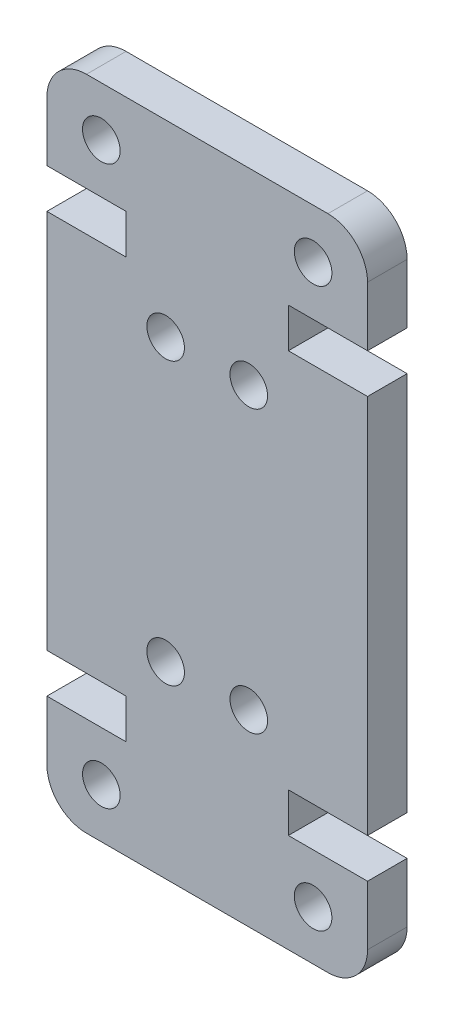
ISO-10303-21;
HEADER;
FILE_DESCRIPTION(('STEP AP214'),'2;1');
FILE_NAME('part.step','',(''),(''),'','','');
FILE_SCHEMA(('AUTOMOTIVE_DESIGN { 1 0 10303 214 1 1 1 1 }'));
ENDSEC;
DATA;
#1=APPLICATION_CONTEXT('core data for automotive mechanical design processes');
#2=APPLICATION_PROTOCOL_DEFINITION('international standard','automotive_design',2000,#1);
#3=PRODUCT_CONTEXT('',#1,'mechanical');
#4=PRODUCT('Part','Part','',(#3));
#5=PRODUCT_RELATED_PRODUCT_CATEGORY('part','',(#4));
#6=PRODUCT_DEFINITION_FORMATION('','',#4);
#7=PRODUCT_DEFINITION_CONTEXT('part definition',#1,'design');
#8=PRODUCT_DEFINITION('design','',#6,#7);
#9=PRODUCT_DEFINITION_SHAPE('','',#8);
#10=(LENGTH_UNIT() NAMED_UNIT(*) SI_UNIT(.MILLI.,.METRE.));
#11=(NAMED_UNIT(*) PLANE_ANGLE_UNIT() SI_UNIT($,.RADIAN.));
#12=(NAMED_UNIT(*) SI_UNIT($,.STERADIAN.) SOLID_ANGLE_UNIT());
#13=UNCERTAINTY_MEASURE_WITH_UNIT(LENGTH_MEASURE(1.E-05),#10,'distance_accuracy_value','');
#14=(GEOMETRIC_REPRESENTATION_CONTEXT(3) GLOBAL_UNCERTAINTY_ASSIGNED_CONTEXT((#13)) GLOBAL_UNIT_ASSIGNED_CONTEXT((#10,
#11,#12)) REPRESENTATION_CONTEXT('',''));
#15=CARTESIAN_POINT('',(0.,0.,0.));
#16=DIRECTION('',(0.,0.,1.));
#17=DIRECTION('',(1.,0.,0.));
#18=AXIS2_PLACEMENT_3D('',#15,#16,#17);
#19=CARTESIAN_POINT('',(2.00000000000001,2.,4.));
#20=DIRECTION('',(0.,0.,1.));
#21=DIRECTION('',(1.,0.,0.));
#22=AXIS2_PLACEMENT_3D('',#19,#20,#21);
#23=PLANE('',#22);
#24=CARTESIAN_POINT('',(10.2,23.7100000000004,4.));
#25=DIRECTION('',(0.,0.,1.));
#26=DIRECTION('',(1.,0.,0.));
#27=AXIS2_PLACEMENT_3D('',#24,#25,#26);
#28=CIRCLE('',#27,0.949999999999999);
#29=CARTESIAN_POINT('',(11.15,23.7100000000004,4.));
#30=VERTEX_POINT('',#29);
#31=EDGE_CURVE('E298',#30,#30,#28,.T.);
#32=ORIENTED_EDGE('',*,*,#31,.F.);
#33=EDGE_LOOP('',(#32));
#34=FACE_BOUND('',#33,.T.);
#35=CARTESIAN_POINT('',(6.,9.49999999999962,4.));
#36=DIRECTION('',(0.,0.,1.));
#37=DIRECTION('',(1.,0.,0.));
#38=AXIS2_PLACEMENT_3D('',#35,#36,#37);
#39=CIRCLE('',#38,0.95);
#40=CARTESIAN_POINT('',(6.95,9.49999999999962,4.));
#41=VERTEX_POINT('',#40);
#42=EDGE_CURVE('E304',#41,#41,#39,.T.);
#43=ORIENTED_EDGE('',*,*,#42,.F.);
#44=EDGE_LOOP('',(#43));
#45=FACE_BOUND('',#44,.T.);
#46=CARTESIAN_POINT('',(2.75000000000003,30.7099999999998,4.));
#47=DIRECTION('',(0.,0.,1.));
#48=DIRECTION('',(-1.,0.,0.));
#49=AXIS2_PLACEMENT_3D('',#46,#47,#48);
#50=CIRCLE('',#49,0.95);
#51=CARTESIAN_POINT('',(1.80000000000003,30.7099999999998,4.));
#52=VERTEX_POINT('',#51);
#53=EDGE_CURVE('E310',#52,#52,#50,.T.);
#54=ORIENTED_EDGE('',*,*,#53,.F.);
#55=EDGE_LOOP('',(#54));
#56=FACE_BOUND('',#55,.T.);
#57=CARTESIAN_POINT('',(13.45,2.50000000000017,4.));
#58=DIRECTION('',(0.,0.,1.));
#59=DIRECTION('',(-1.,0.,0.));
#60=AXIS2_PLACEMENT_3D('',#57,#58,#59);
#61=CIRCLE('',#60,0.949999999999999);
#62=CARTESIAN_POINT('',(12.5,2.50000000000017,4.));
#63=VERTEX_POINT('',#62);
#64=EDGE_CURVE('E316',#63,#63,#61,.T.);
#65=ORIENTED_EDGE('',*,*,#64,.F.);
#66=EDGE_LOOP('',(#65));
#67=FACE_BOUND('',#66,.T.);
#68=DIRECTION('',(1.,0.,0.));
#69=VECTOR('',#68,1.);
#70=CARTESIAN_POINT('',(0.,6.99999999999946,4.));
#71=LINE('',#70,#69);
#72=CARTESIAN_POINT('',(0.,6.99999999999946,4.));
#73=VERTEX_POINT('',#72);
#74=CARTESIAN_POINT('',(4.00000000000001,6.99999999999946,4.));
#75=VERTEX_POINT('',#74);
#76=EDGE_CURVE('E319',#73,#75,#71,.T.);
#77=ORIENTED_EDGE('',*,*,#76,.T.);
#78=DIRECTION('',(0.,-1.,0.));
#79=VECTOR('',#78,1.);
#80=CARTESIAN_POINT('',(4.00000000000001,6.99999999999946,4.));
#81=LINE('',#80,#79);
#82=CARTESIAN_POINT('',(4.,4.99999999999945,4.));
#83=VERTEX_POINT('',#82);
#84=EDGE_CURVE('E286',#75,#83,#81,.T.);
#85=ORIENTED_EDGE('',*,*,#84,.T.);
#86=DIRECTION('',(-1.,0.,0.));
#87=VECTOR('',#86,1.);
#88=CARTESIAN_POINT('',(4.,4.99999999999945,4.));
#89=LINE('',#88,#87);
#90=CARTESIAN_POINT('',(0.,4.99999999999945,4.));
#91=VERTEX_POINT('',#90);
#92=EDGE_CURVE('E282',#83,#91,#89,.T.);
#93=ORIENTED_EDGE('',*,*,#92,.T.);
#94=DIRECTION('',(0.,-1.,0.));
#95=VECTOR('',#94,1.);
#96=CARTESIAN_POINT('',(0.,2.,4.));
#97=LINE('',#96,#95);
#98=CARTESIAN_POINT('',(0.,2.,4.));
#99=VERTEX_POINT('',#98);
#100=EDGE_CURVE('E323',#91,#99,#97,.T.);
#101=ORIENTED_EDGE('',*,*,#100,.T.);
#102=CARTESIAN_POINT('',(2.00000000000001,2.,4.));
#103=DIRECTION('',(0.,0.,1.));
#104=DIRECTION('',(1.,0.,0.));
#105=AXIS2_PLACEMENT_3D('',#102,#103,#104);
#106=CIRCLE('',#105,2.00000000000001);
#107=CARTESIAN_POINT('',(2.00000000000001,0.,4.));
#108=VERTEX_POINT('',#107);
#109=EDGE_CURVE('E325',#99,#108,#106,.T.);
#110=ORIENTED_EDGE('',*,*,#109,.T.);
#111=DIRECTION('',(1.,0.,0.));
#112=VECTOR('',#111,1.);
#113=CARTESIAN_POINT('',(2.00000000000001,0.,4.));
#114=LINE('',#113,#112);
#115=CARTESIAN_POINT('',(14.2,0.,4.));
#116=VERTEX_POINT('',#115);
#117=EDGE_CURVE('E327',#108,#116,#114,.T.);
#118=ORIENTED_EDGE('',*,*,#117,.T.);
#119=CARTESIAN_POINT('',(14.2,2.,4.));
#120=DIRECTION('',(0.,0.,1.));
#121=DIRECTION('',(-1.,0.,0.));
#122=AXIS2_PLACEMENT_3D('',#119,#120,#121);
#123=CIRCLE('',#122,2.);
#124=CARTESIAN_POINT('',(16.2,2.,4.));
#125=VERTEX_POINT('',#124);
#126=EDGE_CURVE('E329',#116,#125,#123,.T.);
#127=ORIENTED_EDGE('',*,*,#126,.T.);
#128=DIRECTION('',(0.,1.,0.));
#129=VECTOR('',#128,1.);
#130=CARTESIAN_POINT('',(16.2,2.,4.));
#131=LINE('',#130,#129);
#132=CARTESIAN_POINT('',(16.2,4.99999999999945,4.));
#133=VERTEX_POINT('',#132);
#134=EDGE_CURVE('E331',#125,#133,#131,.T.);
#135=ORIENTED_EDGE('',*,*,#134,.T.);
#136=DIRECTION('',(-1.,0.,0.));
#137=VECTOR('',#136,1.);
#138=CARTESIAN_POINT('',(12.2,4.99999999999945,4.));
#139=LINE('',#138,#137);
#140=CARTESIAN_POINT('',(12.2,4.99999999999945,4.));
#141=VERTEX_POINT('',#140);
#142=EDGE_CURVE('E333',#133,#141,#139,.T.);
#143=ORIENTED_EDGE('',*,*,#142,.T.);
#144=DIRECTION('',(0.,1.,0.));
#145=VECTOR('',#144,1.);
#146=CARTESIAN_POINT('',(12.2,6.99999999999945,4.));
#147=LINE('',#146,#145);
#148=CARTESIAN_POINT('',(12.2,6.99999999999945,4.));
#149=VERTEX_POINT('',#148);
#150=EDGE_CURVE('E335',#141,#149,#147,.T.);
#151=ORIENTED_EDGE('',*,*,#150,.T.);
#152=DIRECTION('',(1.,0.,0.));
#153=VECTOR('',#152,1.);
#154=CARTESIAN_POINT('',(16.2,6.99999999999945,4.));
#155=LINE('',#154,#153);
#156=CARTESIAN_POINT('',(16.2,6.99999999999945,4.));
#157=VERTEX_POINT('',#156);
#158=EDGE_CURVE('E337',#149,#157,#155,.T.);
#159=ORIENTED_EDGE('',*,*,#158,.T.);
#160=DIRECTION('',(0.,1.,0.));
#161=VECTOR('',#160,1.);
#162=CARTESIAN_POINT('',(16.2,26.2100000000006,4.));
#163=LINE('',#162,#161);
#164=CARTESIAN_POINT('',(16.2,26.2100000000006,4.));
#165=VERTEX_POINT('',#164);
#166=EDGE_CURVE('E339',#157,#165,#163,.T.);
#167=ORIENTED_EDGE('',*,*,#166,.T.);
#168=DIRECTION('',(-1.,0.,0.));
#169=VECTOR('',#168,1.);
#170=CARTESIAN_POINT('',(16.2,26.2100000000006,4.));
#171=LINE('',#170,#169);
#172=CARTESIAN_POINT('',(12.2,26.2100000000006,4.));
#173=VERTEX_POINT('',#172);
#174=EDGE_CURVE('E341',#165,#173,#171,.T.);
#175=ORIENTED_EDGE('',*,*,#174,.T.);
#176=DIRECTION('',(0.,1.,0.));
#177=VECTOR('',#176,1.);
#178=CARTESIAN_POINT('',(12.2,26.2100000000006,4.));
#179=LINE('',#178,#177);
#180=CARTESIAN_POINT('',(12.2,28.2100000000006,4.));
#181=VERTEX_POINT('',#180);
#182=EDGE_CURVE('E343',#173,#181,#179,.T.);
#183=ORIENTED_EDGE('',*,*,#182,.T.);
#184=DIRECTION('',(1.,0.,0.));
#185=VECTOR('',#184,1.);
#186=CARTESIAN_POINT('',(12.2,28.2100000000006,4.));
#187=LINE('',#186,#185);
#188=CARTESIAN_POINT('',(16.2,28.2100000000006,4.));
#189=VERTEX_POINT('',#188);
#190=EDGE_CURVE('E345',#181,#189,#187,.T.);
#191=ORIENTED_EDGE('',*,*,#190,.T.);
#192=DIRECTION('',(0.,1.,0.));
#193=VECTOR('',#192,1.);
#194=CARTESIAN_POINT('',(16.2,31.21,4.));
#195=LINE('',#194,#193);
#196=CARTESIAN_POINT('',(16.2,31.21,4.));
#197=VERTEX_POINT('',#196);
#198=EDGE_CURVE('E347',#189,#197,#195,.T.);
#199=ORIENTED_EDGE('',*,*,#198,.T.);
#200=CARTESIAN_POINT('',(14.2,31.21,4.));
#201=DIRECTION('',(0.,0.,1.));
#202=DIRECTION('',(1.,0.,0.));
#203=AXIS2_PLACEMENT_3D('',#200,#201,#202);
#204=CIRCLE('',#203,2.);
#205=CARTESIAN_POINT('',(14.2,33.21,4.));
#206=VERTEX_POINT('',#205);
#207=EDGE_CURVE('E349',#197,#206,#204,.T.);
#208=ORIENTED_EDGE('',*,*,#207,.T.);
#209=DIRECTION('',(-1.,0.,0.));
#210=VECTOR('',#209,1.);
#211=CARTESIAN_POINT('',(1.99999999999999,33.21,4.));
#212=LINE('',#211,#210);
#213=CARTESIAN_POINT('',(1.99999999999999,33.21,4.));
#214=VERTEX_POINT('',#213);
#215=EDGE_CURVE('E351',#206,#214,#212,.T.);
#216=ORIENTED_EDGE('',*,*,#215,.T.);
#217=CARTESIAN_POINT('',(1.99999999999999,31.21,4.));
#218=DIRECTION('',(0.,0.,1.));
#219=DIRECTION('',(-1.,0.,0.));
#220=AXIS2_PLACEMENT_3D('',#217,#218,#219);
#221=CIRCLE('',#220,2.);
#222=CARTESIAN_POINT('',(0.,31.21,4.));
#223=VERTEX_POINT('',#222);
#224=EDGE_CURVE('E353',#214,#223,#221,.T.);
#225=ORIENTED_EDGE('',*,*,#224,.T.);
#226=DIRECTION('',(0.,-1.,0.));
#227=VECTOR('',#226,1.);
#228=CARTESIAN_POINT('',(0.,31.21,4.));
#229=LINE('',#228,#227);
#230=CARTESIAN_POINT('',(0.,28.2100000000006,4.));
#231=VERTEX_POINT('',#230);
#232=EDGE_CURVE('E221',#223,#231,#229,.T.);
#233=ORIENTED_EDGE('',*,*,#232,.T.);
#234=DIRECTION('',(1.,0.,0.));
#235=VECTOR('',#234,1.);
#236=CARTESIAN_POINT('',(3.99999999999999,28.2100000000006,4.));
#237=LINE('',#236,#235);
#238=CARTESIAN_POINT('',(3.99999999999999,28.2100000000006,4.));
#239=VERTEX_POINT('',#238);
#240=EDGE_CURVE('E356',#231,#239,#237,.T.);
#241=ORIENTED_EDGE('',*,*,#240,.T.);
#242=DIRECTION('',(0.,-1.,0.));
#243=VECTOR('',#242,1.);
#244=CARTESIAN_POINT('',(4.,26.2100000000006,4.));
#245=LINE('',#244,#243);
#246=CARTESIAN_POINT('',(4.,26.2100000000006,4.));
#247=VERTEX_POINT('',#246);
#248=EDGE_CURVE('E358',#239,#247,#245,.T.);
#249=ORIENTED_EDGE('',*,*,#248,.T.);
#250=DIRECTION('',(-1.,0.,0.));
#251=VECTOR('',#250,1.);
#252=CARTESIAN_POINT('',(0.,26.2100000000005,4.));
#253=LINE('',#252,#251);
#254=CARTESIAN_POINT('',(0.,26.2100000000005,4.));
#255=VERTEX_POINT('',#254);
#256=EDGE_CURVE('E360',#247,#255,#253,.T.);
#257=ORIENTED_EDGE('',*,*,#256,.T.);
#258=DIRECTION('',(0.,-1.,0.));
#259=VECTOR('',#258,1.);
#260=CARTESIAN_POINT('',(0.,26.2100000000005,4.));
#261=LINE('',#260,#259);
#262=EDGE_CURVE('E57',#255,#73,#261,.T.);
#263=ORIENTED_EDGE('',*,*,#262,.T.);
#264=EDGE_LOOP('',(#77,#85,#93,#101,#110,#118,#127,#135,#143,#151,#159,#167,#175,#183,#191,#199,
#208,#216,#225,#233,#241,#249,#257,#263));
#265=FACE_BOUND('',#264,.T.);
#266=CARTESIAN_POINT('',(10.2,9.49999999999962,4.));
#267=DIRECTION('',(0.,0.,1.));
#268=DIRECTION('',(-1.,0.,0.));
#269=AXIS2_PLACEMENT_3D('',#266,#267,#268);
#270=CIRCLE('',#269,0.949999999999999);
#271=CARTESIAN_POINT('',(9.25,9.49999999999962,4.));
#272=VERTEX_POINT('',#271);
#273=EDGE_CURVE('E313',#272,#272,#270,.T.);
#274=ORIENTED_EDGE('',*,*,#273,.F.);
#275=EDGE_LOOP('',(#274));
#276=FACE_BOUND('',#275,.T.);
#277=CARTESIAN_POINT('',(5.99999999999999,23.7100000000004,4.));
#278=DIRECTION('',(0.,0.,1.));
#279=DIRECTION('',(-1.,0.,0.));
#280=AXIS2_PLACEMENT_3D('',#277,#278,#279);
#281=CIRCLE('',#280,0.949999999999999);
#282=CARTESIAN_POINT('',(5.05,23.7100000000004,4.));
#283=VERTEX_POINT('',#282);
#284=EDGE_CURVE('E307',#283,#283,#281,.T.);
#285=ORIENTED_EDGE('',*,*,#284,.F.);
#286=EDGE_LOOP('',(#285));
#287=FACE_BOUND('',#286,.T.);
#288=CARTESIAN_POINT('',(2.75000000000004,2.50000000000017,4.));
#289=DIRECTION('',(0.,0.,1.));
#290=DIRECTION('',(1.,0.,0.));
#291=AXIS2_PLACEMENT_3D('',#288,#289,#290);
#292=CIRCLE('',#291,0.95);
#293=CARTESIAN_POINT('',(3.70000000000004,2.50000000000017,4.));
#294=VERTEX_POINT('',#293);
#295=EDGE_CURVE('E301',#294,#294,#292,.T.);
#296=ORIENTED_EDGE('',*,*,#295,.F.);
#297=EDGE_LOOP('',(#296));
#298=FACE_BOUND('',#297,.T.);
#299=CARTESIAN_POINT('',(13.45,30.7099999999998,4.));
#300=DIRECTION('',(0.,0.,1.));
#301=DIRECTION('',(1.,0.,0.));
#302=AXIS2_PLACEMENT_3D('',#299,#300,#301);
#303=CIRCLE('',#302,0.949999999999999);
#304=CARTESIAN_POINT('',(14.4,30.7099999999998,4.));
#305=VERTEX_POINT('',#304);
#306=EDGE_CURVE('E290',#305,#305,#303,.T.);
#307=ORIENTED_EDGE('',*,*,#306,.F.);
#308=EDGE_LOOP('',(#307));
#309=FACE_BOUND('',#308,.T.);
#310=ADVANCED_FACE('F33',(#34,#45,#56,#67,#265,#276,#287,#298,#309),#23,.T.);
#311=CARTESIAN_POINT('',(0.,6.99999999999946,4.));
#312=DIRECTION('',(0.,1.,0.));
#313=DIRECTION('',(0.,0.,1.));
#314=AXIS2_PLACEMENT_3D('',#311,#312,#313);
#315=PLANE('',#314);
#316=DIRECTION('',(0.,0.,-1.));
#317=VECTOR('',#316,1.);
#318=CARTESIAN_POINT('',(0.,6.99999999999946,4.));
#319=LINE('',#318,#317);
#320=CARTESIAN_POINT('',(0.,6.99999999999946,2.));
#321=VERTEX_POINT('',#320);
#322=EDGE_CURVE('E363',#73,#321,#319,.T.);
#323=ORIENTED_EDGE('',*,*,#322,.T.);
#324=DIRECTION('',(1.,0.,0.));
#325=VECTOR('',#324,1.);
#326=CARTESIAN_POINT('',(0.,6.99999999999946,2.));
#327=LINE('',#326,#325);
#328=CARTESIAN_POINT('',(4.00000000000001,6.99999999999946,2.));
#329=VERTEX_POINT('',#328);
#330=EDGE_CURVE('E49',#321,#329,#327,.T.);
#331=ORIENTED_EDGE('',*,*,#330,.T.);
#332=DIRECTION('',(0.,0.,-1.));
#333=VECTOR('',#332,1.);
#334=CARTESIAN_POINT('',(4.00000000000001,6.99999999999946,4.));
#335=LINE('',#334,#333);
#336=EDGE_CURVE('E11',#75,#329,#335,.T.);
#337=ORIENTED_EDGE('',*,*,#336,.F.);
#338=ORIENTED_EDGE('',*,*,#76,.F.);
#339=EDGE_LOOP('',(#323,#331,#337,#338));
#340=FACE_BOUND('',#339,.T.);
#341=ADVANCED_FACE('F35',(#340),#315,.F.);
#342=CARTESIAN_POINT('',(4.00000000000001,6.99999999999946,4.));
#343=DIRECTION('',(1.,0.,0.));
#344=DIRECTION('',(0.,1.,0.));
#345=AXIS2_PLACEMENT_3D('',#342,#343,#344);
#346=PLANE('',#345);
#347=ORIENTED_EDGE('',*,*,#336,.T.);
#348=DIRECTION('',(0.,-1.,0.));
#349=VECTOR('',#348,1.);
#350=CARTESIAN_POINT('',(4.00000000000001,6.99999999999946,2.));
#351=LINE('',#350,#349);
#352=CARTESIAN_POINT('',(4.,4.99999999999945,2.));
#353=VERTEX_POINT('',#352);
#354=EDGE_CURVE('E287',#329,#353,#351,.T.);
#355=ORIENTED_EDGE('',*,*,#354,.T.);
#356=DIRECTION('',(0.,0.,-1.));
#357=VECTOR('',#356,1.);
#358=CARTESIAN_POINT('',(4.,4.99999999999945,4.));
#359=LINE('',#358,#357);
#360=EDGE_CURVE('E42',#83,#353,#359,.T.);
#361=ORIENTED_EDGE('',*,*,#360,.F.);
#362=ORIENTED_EDGE('',*,*,#84,.F.);
#363=EDGE_LOOP('',(#347,#355,#361,#362));
#364=FACE_BOUND('',#363,.T.);
#365=ADVANCED_FACE('F285',(#364),#346,.F.);
#366=CARTESIAN_POINT('',(4.,4.99999999999945,4.));
#367=DIRECTION('',(0.,-1.,0.));
#368=DIRECTION('',(0.,0.,-1.));
#369=AXIS2_PLACEMENT_3D('',#366,#367,#368);
#370=PLANE('',#369);
#371=ORIENTED_EDGE('',*,*,#360,.T.);
#372=DIRECTION('',(-1.,0.,0.));
#373=VECTOR('',#372,1.);
#374=CARTESIAN_POINT('',(4.,4.99999999999945,2.));
#375=LINE('',#374,#373);
#376=CARTESIAN_POINT('',(0.,4.99999999999945,2.));
#377=VERTEX_POINT('',#376);
#378=EDGE_CURVE('E281',#353,#377,#375,.T.);
#379=ORIENTED_EDGE('',*,*,#378,.T.);
#380=DIRECTION('',(0.,0.,-1.));
#381=VECTOR('',#380,1.);
#382=CARTESIAN_POINT('',(0.,4.99999999999945,4.));
#383=LINE('',#382,#381);
#384=EDGE_CURVE('E271',#91,#377,#383,.T.);
#385=ORIENTED_EDGE('',*,*,#384,.F.);
#386=ORIENTED_EDGE('',*,*,#92,.F.);
#387=EDGE_LOOP('',(#371,#379,#385,#386));
#388=FACE_BOUND('',#387,.T.);
#389=ADVANCED_FACE('F279',(#388),#370,.F.);
#390=CARTESIAN_POINT('',(0.,2.,4.));
#391=DIRECTION('',(1.,0.,0.));
#392=DIRECTION('',(0.,0.,-1.));
#393=AXIS2_PLACEMENT_3D('',#390,#391,#392);
#394=PLANE('',#393);
#395=ORIENTED_EDGE('',*,*,#384,.T.);
#396=DIRECTION('',(0.,-1.,0.));
#397=VECTOR('',#396,1.);
#398=CARTESIAN_POINT('',(0.,33.21,2.));
#399=LINE('',#398,#397);
#400=CARTESIAN_POINT('',(0.,2.,2.));
#401=VERTEX_POINT('',#400);
#402=EDGE_CURVE('E208',#377,#401,#399,.T.);
#403=ORIENTED_EDGE('',*,*,#402,.T.);
#404=DIRECTION('',(0.,0.,-1.));
#405=VECTOR('',#404,1.);
#406=CARTESIAN_POINT('',(0.,2.,4.));
#407=LINE('',#406,#405);
#408=EDGE_CURVE('E268',#99,#401,#407,.T.);
#409=ORIENTED_EDGE('',*,*,#408,.F.);
#410=ORIENTED_EDGE('',*,*,#100,.F.);
#411=EDGE_LOOP('',(#395,#403,#409,#410));
#412=FACE_BOUND('',#411,.T.);
#413=ADVANCED_FACE('F426',(#412),#394,.F.);
#414=CARTESIAN_POINT('',(2.00000000000001,2.,4.));
#415=DIRECTION('',(0.,0.,-1.));
#416=DIRECTION('',(-1.,0.,0.));
#417=AXIS2_PLACEMENT_3D('',#414,#415,#416);
#418=CYLINDRICAL_SURFACE('',#417,2.00000000000001);
#419=ORIENTED_EDGE('',*,*,#408,.T.);
#420=CARTESIAN_POINT('',(2.00000000000001,2.,2.));
#421=DIRECTION('',(0.,0.,1.));
#422=DIRECTION('',(1.,0.,0.));
#423=AXIS2_PLACEMENT_3D('',#420,#421,#422);
#424=CIRCLE('',#423,2.00000000000001);
#425=CARTESIAN_POINT('',(2.00000000000001,0.,2.));
#426=VERTEX_POINT('',#425);
#427=EDGE_CURVE('E292',#401,#426,#424,.T.);
#428=ORIENTED_EDGE('',*,*,#427,.T.);
#429=DIRECTION('',(0.,0.,-1.));
#430=VECTOR('',#429,1.);
#431=CARTESIAN_POINT('',(2.00000000000001,0.,4.));
#432=LINE('',#431,#430);
#433=EDGE_CURVE('E265',#108,#426,#432,.T.);
#434=ORIENTED_EDGE('',*,*,#433,.F.);
#435=ORIENTED_EDGE('',*,*,#109,.F.);
#436=EDGE_LOOP('',(#419,#428,#434,#435));
#437=FACE_BOUND('',#436,.T.);
#438=ADVANCED_FACE('F412',(#437),#418,.T.);
#439=CARTESIAN_POINT('',(2.00000000000001,0.,4.));
#440=DIRECTION('',(0.,1.,0.));
#441=DIRECTION('',(-1.,0.,0.));
#442=AXIS2_PLACEMENT_3D('',#439,#440,#441);
#443=PLANE('',#442);
#444=ORIENTED_EDGE('',*,*,#433,.T.);
#445=DIRECTION('',(1.,0.,0.));
#446=VECTOR('',#445,1.);
#447=CARTESIAN_POINT('',(0.,0.,2.));
#448=LINE('',#447,#446);
#449=CARTESIAN_POINT('',(14.2,0.,2.));
#450=VERTEX_POINT('',#449);
#451=EDGE_CURVE('E205',#426,#450,#448,.T.);
#452=ORIENTED_EDGE('',*,*,#451,.T.);
#453=DIRECTION('',(0.,0.,-1.));
#454=VECTOR('',#453,1.);
#455=CARTESIAN_POINT('',(14.2,0.,4.));
#456=LINE('',#455,#454);
#457=EDGE_CURVE('E262',#116,#450,#456,.T.);
#458=ORIENTED_EDGE('',*,*,#457,.F.);
#459=ORIENTED_EDGE('',*,*,#117,.F.);
#460=EDGE_LOOP('',(#444,#452,#458,#459));
#461=FACE_BOUND('',#460,.T.);
#462=ADVANCED_FACE('F419',(#461),#443,.F.);
#463=CARTESIAN_POINT('',(14.2,2.,4.));
#464=DIRECTION('',(0.,0.,-1.));
#465=DIRECTION('',(-1.,0.,0.));
#466=AXIS2_PLACEMENT_3D('',#463,#464,#465);
#467=CYLINDRICAL_SURFACE('',#466,2.);
#468=ORIENTED_EDGE('',*,*,#457,.T.);
#469=CARTESIAN_POINT('',(14.2,2.,2.));
#470=DIRECTION('',(0.,0.,1.));
#471=DIRECTION('',(1.,0.,0.));
#472=AXIS2_PLACEMENT_3D('',#469,#470,#471);
#473=CIRCLE('',#472,2.);
#474=CARTESIAN_POINT('',(16.2,2.,2.));
#475=VERTEX_POINT('',#474);
#476=EDGE_CURVE('E407',#450,#475,#473,.T.);
#477=ORIENTED_EDGE('',*,*,#476,.T.);
#478=DIRECTION('',(0.,0.,-1.));
#479=VECTOR('',#478,1.);
#480=CARTESIAN_POINT('',(16.2,2.,4.));
#481=LINE('',#480,#479);
#482=EDGE_CURVE('E259',#125,#475,#481,.T.);
#483=ORIENTED_EDGE('',*,*,#482,.F.);
#484=ORIENTED_EDGE('',*,*,#126,.F.);
#485=EDGE_LOOP('',(#468,#477,#483,#484));
#486=FACE_BOUND('',#485,.T.);
#487=ADVANCED_FACE('F535',(#486),#467,.T.);
#488=CARTESIAN_POINT('',(16.2,2.,4.));
#489=DIRECTION('',(-1.,0.,0.));
#490=DIRECTION('',(0.,0.,1.));
#491=AXIS2_PLACEMENT_3D('',#488,#489,#490);
#492=PLANE('',#491);
#493=ORIENTED_EDGE('',*,*,#482,.T.);
#494=DIRECTION('',(0.,1.,0.));
#495=VECTOR('',#494,1.);
#496=CARTESIAN_POINT('',(16.2,0.,2.));
#497=LINE('',#496,#495);
#498=CARTESIAN_POINT('',(16.2,4.99999999999945,2.));
#499=VERTEX_POINT('',#498);
#500=EDGE_CURVE('E433',#475,#499,#497,.T.);
#501=ORIENTED_EDGE('',*,*,#500,.T.);
#502=DIRECTION('',(0.,0.,-1.));
#503=VECTOR('',#502,1.);
#504=CARTESIAN_POINT('',(16.2,4.99999999999945,4.));
#505=LINE('',#504,#503);
#506=EDGE_CURVE('E256',#133,#499,#505,.T.);
#507=ORIENTED_EDGE('',*,*,#506,.F.);
#508=ORIENTED_EDGE('',*,*,#134,.F.);
#509=EDGE_LOOP('',(#493,#501,#507,#508));
#510=FACE_BOUND('',#509,.T.);
#511=ADVANCED_FACE('F531',(#510),#492,.F.);
#512=CARTESIAN_POINT('',(12.2,4.99999999999945,4.));
#513=DIRECTION('',(0.,-1.,0.));
#514=DIRECTION('',(0.,0.,-1.));
#515=AXIS2_PLACEMENT_3D('',#512,#513,#514);
#516=PLANE('',#515);
#517=ORIENTED_EDGE('',*,*,#506,.T.);
#518=DIRECTION('',(-1.,0.,0.));
#519=VECTOR('',#518,1.);
#520=CARTESIAN_POINT('',(12.2,4.99999999999945,2.));
#521=LINE('',#520,#519);
#522=CARTESIAN_POINT('',(12.2,4.99999999999945,2.));
#523=VERTEX_POINT('',#522);
#524=EDGE_CURVE('E404',#499,#523,#521,.T.);
#525=ORIENTED_EDGE('',*,*,#524,.T.);
#526=DIRECTION('',(0.,0.,-1.));
#527=VECTOR('',#526,1.);
#528=CARTESIAN_POINT('',(12.2,4.99999999999945,4.));
#529=LINE('',#528,#527);
#530=EDGE_CURVE('E253',#141,#523,#529,.T.);
#531=ORIENTED_EDGE('',*,*,#530,.F.);
#532=ORIENTED_EDGE('',*,*,#142,.F.);
#533=EDGE_LOOP('',(#517,#525,#531,#532));
#534=FACE_BOUND('',#533,.T.);
#535=ADVANCED_FACE('F527',(#534),#516,.F.);
#536=CARTESIAN_POINT('',(12.2,6.99999999999945,4.));
#537=DIRECTION('',(-1.,0.,0.));
#538=DIRECTION('',(0.,0.,1.));
#539=AXIS2_PLACEMENT_3D('',#536,#537,#538);
#540=PLANE('',#539);
#541=ORIENTED_EDGE('',*,*,#530,.T.);
#542=DIRECTION('',(0.,1.,0.));
#543=VECTOR('',#542,1.);
#544=CARTESIAN_POINT('',(12.2,6.99999999999945,2.));
#545=LINE('',#544,#543);
#546=CARTESIAN_POINT('',(12.2,6.99999999999945,2.));
#547=VERTEX_POINT('',#546);
#548=EDGE_CURVE('E401',#523,#547,#545,.T.);
#549=ORIENTED_EDGE('',*,*,#548,.T.);
#550=DIRECTION('',(0.,0.,-1.));
#551=VECTOR('',#550,1.);
#552=CARTESIAN_POINT('',(12.2,6.99999999999945,4.));
#553=LINE('',#552,#551);
#554=EDGE_CURVE('E250',#149,#547,#553,.T.);
#555=ORIENTED_EDGE('',*,*,#554,.F.);
#556=ORIENTED_EDGE('',*,*,#150,.F.);
#557=EDGE_LOOP('',(#541,#549,#555,#556));
#558=FACE_BOUND('',#557,.T.);
#559=ADVANCED_FACE('F523',(#558),#540,.F.);
#560=CARTESIAN_POINT('',(16.2,6.99999999999945,4.));
#561=DIRECTION('',(0.,1.,0.));
#562=DIRECTION('',(-1.,0.,0.));
#563=AXIS2_PLACEMENT_3D('',#560,#561,#562);
#564=PLANE('',#563);
#565=ORIENTED_EDGE('',*,*,#554,.T.);
#566=DIRECTION('',(1.,0.,0.));
#567=VECTOR('',#566,1.);
#568=CARTESIAN_POINT('',(16.2,6.99999999999945,2.));
#569=LINE('',#568,#567);
#570=CARTESIAN_POINT('',(16.2,6.99999999999945,2.));
#571=VERTEX_POINT('',#570);
#572=EDGE_CURVE('E398',#547,#571,#569,.T.);
#573=ORIENTED_EDGE('',*,*,#572,.T.);
#574=DIRECTION('',(0.,0.,-1.));
#575=VECTOR('',#574,1.);
#576=CARTESIAN_POINT('',(16.2,6.99999999999945,4.));
#577=LINE('',#576,#575);
#578=EDGE_CURVE('E247',#157,#571,#577,.T.);
#579=ORIENTED_EDGE('',*,*,#578,.F.);
#580=ORIENTED_EDGE('',*,*,#158,.F.);
#581=EDGE_LOOP('',(#565,#573,#579,#580));
#582=FACE_BOUND('',#581,.T.);
#583=ADVANCED_FACE('F519',(#582),#564,.F.);
#584=CARTESIAN_POINT('',(16.2,26.2100000000006,4.));
#585=DIRECTION('',(-1.,0.,0.));
#586=DIRECTION('',(0.,0.,1.));
#587=AXIS2_PLACEMENT_3D('',#584,#585,#586);
#588=PLANE('',#587);
#589=ORIENTED_EDGE('',*,*,#578,.T.);
#590=CARTESIAN_POINT('',(16.2,26.2100000000006,2.));
#591=VERTEX_POINT('',#590);
#592=EDGE_CURVE('E432',#571,#591,#497,.T.);
#593=ORIENTED_EDGE('',*,*,#592,.T.);
#594=DIRECTION('',(0.,0.,-1.));
#595=VECTOR('',#594,1.);
#596=CARTESIAN_POINT('',(16.2,26.2100000000006,4.));
#597=LINE('',#596,#595);
#598=EDGE_CURVE('E244',#165,#591,#597,.T.);
#599=ORIENTED_EDGE('',*,*,#598,.F.);
#600=ORIENTED_EDGE('',*,*,#166,.F.);
#601=EDGE_LOOP('',(#589,#593,#599,#600));
#602=FACE_BOUND('',#601,.T.);
#603=ADVANCED_FACE('F515',(#602),#588,.F.);
#604=CARTESIAN_POINT('',(16.2,26.2100000000006,4.));
#605=DIRECTION('',(0.,-1.,0.));
#606=DIRECTION('',(0.,0.,-1.));
#607=AXIS2_PLACEMENT_3D('',#604,#605,#606);
#608=PLANE('',#607);
#609=ORIENTED_EDGE('',*,*,#598,.T.);
#610=DIRECTION('',(-1.,0.,0.));
#611=VECTOR('',#610,1.);
#612=CARTESIAN_POINT('',(16.2,26.2100000000006,2.));
#613=LINE('',#612,#611);
#614=CARTESIAN_POINT('',(12.2,26.2100000000006,2.));
#615=VERTEX_POINT('',#614);
#616=EDGE_CURVE('E395',#591,#615,#613,.T.);
#617=ORIENTED_EDGE('',*,*,#616,.T.);
#618=DIRECTION('',(0.,0.,-1.));
#619=VECTOR('',#618,1.);
#620=CARTESIAN_POINT('',(12.2,26.2100000000006,4.));
#621=LINE('',#620,#619);
#622=EDGE_CURVE('E241',#173,#615,#621,.T.);
#623=ORIENTED_EDGE('',*,*,#622,.F.);
#624=ORIENTED_EDGE('',*,*,#174,.F.);
#625=EDGE_LOOP('',(#609,#617,#623,#624));
#626=FACE_BOUND('',#625,.T.);
#627=ADVANCED_FACE('F511',(#626),#608,.F.);
#628=CARTESIAN_POINT('',(12.2,26.2100000000006,4.));
#629=DIRECTION('',(-1.,0.,0.));
#630=DIRECTION('',(0.,-1.,0.));
#631=AXIS2_PLACEMENT_3D('',#628,#629,#630);
#632=PLANE('',#631);
#633=ORIENTED_EDGE('',*,*,#622,.T.);
#634=DIRECTION('',(0.,1.,0.));
#635=VECTOR('',#634,1.);
#636=CARTESIAN_POINT('',(12.2,26.2100000000006,2.));
#637=LINE('',#636,#635);
#638=CARTESIAN_POINT('',(12.2,28.2100000000006,2.));
#639=VERTEX_POINT('',#638);
#640=EDGE_CURVE('E392',#615,#639,#637,.T.);
#641=ORIENTED_EDGE('',*,*,#640,.T.);
#642=DIRECTION('',(0.,0.,-1.));
#643=VECTOR('',#642,1.);
#644=CARTESIAN_POINT('',(12.2,28.2100000000006,4.));
#645=LINE('',#644,#643);
#646=EDGE_CURVE('E238',#181,#639,#645,.T.);
#647=ORIENTED_EDGE('',*,*,#646,.F.);
#648=ORIENTED_EDGE('',*,*,#182,.F.);
#649=EDGE_LOOP('',(#633,#641,#647,#648));
#650=FACE_BOUND('',#649,.T.);
#651=ADVANCED_FACE('F507',(#650),#632,.F.);
#652=CARTESIAN_POINT('',(12.2,28.2100000000006,4.));
#653=DIRECTION('',(0.,1.,0.));
#654=DIRECTION('',(0.,0.,1.));
#655=AXIS2_PLACEMENT_3D('',#652,#653,#654);
#656=PLANE('',#655);
#657=ORIENTED_EDGE('',*,*,#646,.T.);
#658=DIRECTION('',(1.,0.,0.));
#659=VECTOR('',#658,1.);
#660=CARTESIAN_POINT('',(12.2,28.2100000000006,2.));
#661=LINE('',#660,#659);
#662=CARTESIAN_POINT('',(16.2,28.2100000000006,2.));
#663=VERTEX_POINT('',#662);
#664=EDGE_CURVE('E389',#639,#663,#661,.T.);
#665=ORIENTED_EDGE('',*,*,#664,.T.);
#666=DIRECTION('',(0.,0.,-1.));
#667=VECTOR('',#666,1.);
#668=CARTESIAN_POINT('',(16.2,28.2100000000006,4.));
#669=LINE('',#668,#667);
#670=EDGE_CURVE('E235',#189,#663,#669,.T.);
#671=ORIENTED_EDGE('',*,*,#670,.F.);
#672=ORIENTED_EDGE('',*,*,#190,.F.);
#673=EDGE_LOOP('',(#657,#665,#671,#672));
#674=FACE_BOUND('',#673,.T.);
#675=ADVANCED_FACE('F503',(#674),#656,.F.);
#676=CARTESIAN_POINT('',(16.2,31.21,4.));
#677=DIRECTION('',(-1.,0.,0.));
#678=DIRECTION('',(0.,0.,1.));
#679=AXIS2_PLACEMENT_3D('',#676,#677,#678);
#680=PLANE('',#679);
#681=ORIENTED_EDGE('',*,*,#670,.T.);
#682=CARTESIAN_POINT('',(16.2,31.21,2.));
#683=VERTEX_POINT('',#682);
#684=EDGE_CURVE('E429',#663,#683,#497,.T.);
#685=ORIENTED_EDGE('',*,*,#684,.T.);
#686=DIRECTION('',(0.,0.,-1.));
#687=VECTOR('',#686,1.);
#688=CARTESIAN_POINT('',(16.2,31.21,4.));
#689=LINE('',#688,#687);
#690=EDGE_CURVE('E232',#197,#683,#689,.T.);
#691=ORIENTED_EDGE('',*,*,#690,.F.);
#692=ORIENTED_EDGE('',*,*,#198,.F.);
#693=EDGE_LOOP('',(#681,#685,#691,#692));
#694=FACE_BOUND('',#693,.T.);
#695=ADVANCED_FACE('F499',(#694),#680,.F.);
#696=CARTESIAN_POINT('',(14.2,31.21,4.));
#697=DIRECTION('',(0.,0.,-1.));
#698=DIRECTION('',(-1.,0.,0.));
#699=AXIS2_PLACEMENT_3D('',#696,#697,#698);
#700=CYLINDRICAL_SURFACE('',#699,2.);
#701=ORIENTED_EDGE('',*,*,#690,.T.);
#702=CARTESIAN_POINT('',(14.2,31.21,2.));
#703=DIRECTION('',(0.,0.,1.));
#704=DIRECTION('',(1.,0.,0.));
#705=AXIS2_PLACEMENT_3D('',#702,#703,#704);
#706=CIRCLE('',#705,2.);
#707=CARTESIAN_POINT('',(14.2,33.21,2.));
#708=VERTEX_POINT('',#707);
#709=EDGE_CURVE('E218',#683,#708,#706,.T.);
#710=ORIENTED_EDGE('',*,*,#709,.T.);
#711=DIRECTION('',(0.,0.,-1.));
#712=VECTOR('',#711,1.);
#713=CARTESIAN_POINT('',(14.2,33.21,4.));
#714=LINE('',#713,#712);
#715=EDGE_CURVE('E224',#206,#708,#714,.T.);
#716=ORIENTED_EDGE('',*,*,#715,.F.);
#717=ORIENTED_EDGE('',*,*,#207,.F.);
#718=EDGE_LOOP('',(#701,#710,#716,#717));
#719=FACE_BOUND('',#718,.T.);
#720=ADVANCED_FACE('F495',(#719),#700,.T.);
#721=CARTESIAN_POINT('',(1.99999999999999,33.21,4.));
#722=DIRECTION('',(0.,-1.,0.));
#723=DIRECTION('',(0.,0.,-1.));
#724=AXIS2_PLACEMENT_3D('',#721,#722,#723);
#725=PLANE('',#724);
#726=ORIENTED_EDGE('',*,*,#715,.T.);
#727=DIRECTION('',(-1.,0.,0.));
#728=VECTOR('',#727,1.);
#729=CARTESIAN_POINT('',(16.2,33.21,2.));
#730=LINE('',#729,#728);
#731=CARTESIAN_POINT('',(1.99999999999999,33.21,2.));
#732=VERTEX_POINT('',#731);
#733=EDGE_CURVE('E434',#708,#732,#730,.T.);
#734=ORIENTED_EDGE('',*,*,#733,.T.);
#735=DIRECTION('',(0.,0.,-1.));
#736=VECTOR('',#735,1.);
#737=CARTESIAN_POINT('',(1.99999999999999,33.21,4.));
#738=LINE('',#737,#736);
#739=EDGE_CURVE('E217',#214,#732,#738,.T.);
#740=ORIENTED_EDGE('',*,*,#739,.F.);
#741=ORIENTED_EDGE('',*,*,#215,.F.);
#742=EDGE_LOOP('',(#726,#734,#740,#741));
#743=FACE_BOUND('',#742,.T.);
#744=ADVANCED_FACE('F492',(#743),#725,.F.);
#745=CARTESIAN_POINT('',(1.99999999999999,31.21,4.));
#746=DIRECTION('',(0.,0.,-1.));
#747=DIRECTION('',(-1.,0.,0.));
#748=AXIS2_PLACEMENT_3D('',#745,#746,#747);
#749=CYLINDRICAL_SURFACE('',#748,2.);
#750=ORIENTED_EDGE('',*,*,#739,.T.);
#751=CARTESIAN_POINT('',(1.99999999999999,31.21,2.));
#752=DIRECTION('',(0.,0.,1.));
#753=DIRECTION('',(1.,0.,0.));
#754=AXIS2_PLACEMENT_3D('',#751,#752,#753);
#755=CIRCLE('',#754,2.);
#756=CARTESIAN_POINT('',(0.,31.21,2.));
#757=VERTEX_POINT('',#756);
#758=EDGE_CURVE('E197',#732,#757,#755,.T.);
#759=ORIENTED_EDGE('',*,*,#758,.T.);
#760=DIRECTION('',(0.,0.,-1.));
#761=VECTOR('',#760,1.);
#762=CARTESIAN_POINT('',(0.,31.21,4.));
#763=LINE('',#762,#761);
#764=EDGE_CURVE('E214',#223,#757,#763,.T.);
#765=ORIENTED_EDGE('',*,*,#764,.F.);
#766=ORIENTED_EDGE('',*,*,#224,.F.);
#767=EDGE_LOOP('',(#750,#759,#765,#766));
#768=FACE_BOUND('',#767,.T.);
#769=ADVANCED_FACE('F212',(#768),#749,.T.);
#770=CARTESIAN_POINT('',(0.,31.21,4.));
#771=DIRECTION('',(1.,0.,0.));
#772=DIRECTION('',(0.,1.,0.));
#773=AXIS2_PLACEMENT_3D('',#770,#771,#772);
#774=PLANE('',#773);
#775=ORIENTED_EDGE('',*,*,#764,.T.);
#776=CARTESIAN_POINT('',(0.,28.2100000000006,2.));
#777=VERTEX_POINT('',#776);
#778=EDGE_CURVE('E194',#757,#777,#399,.T.);
#779=ORIENTED_EDGE('',*,*,#778,.T.);
#780=DIRECTION('',(0.,0.,-1.));
#781=VECTOR('',#780,1.);
#782=CARTESIAN_POINT('',(0.,28.2100000000006,4.));
#783=LINE('',#782,#781);
#784=EDGE_CURVE('E222',#231,#777,#783,.T.);
#785=ORIENTED_EDGE('',*,*,#784,.F.);
#786=ORIENTED_EDGE('',*,*,#232,.F.);
#787=EDGE_LOOP('',(#775,#779,#785,#786));
#788=FACE_BOUND('',#787,.T.);
#789=ADVANCED_FACE('F220',(#788),#774,.F.);
#790=CARTESIAN_POINT('',(3.99999999999999,28.2100000000006,4.));
#791=DIRECTION('',(0.,1.,0.));
#792=DIRECTION('',(-1.,0.,0.));
#793=AXIS2_PLACEMENT_3D('',#790,#791,#792);
#794=PLANE('',#793);
#795=ORIENTED_EDGE('',*,*,#784,.T.);
#796=DIRECTION('',(1.,0.,0.));
#797=VECTOR('',#796,1.);
#798=CARTESIAN_POINT('',(3.99999999999999,28.2100000000006,2.));
#799=LINE('',#798,#797);
#800=CARTESIAN_POINT('',(3.99999999999999,28.2100000000006,2.));
#801=VERTEX_POINT('',#800);
#802=EDGE_CURVE('E200',#777,#801,#799,.T.);
#803=ORIENTED_EDGE('',*,*,#802,.T.);
#804=DIRECTION('',(0.,0.,-1.));
#805=VECTOR('',#804,1.);
#806=CARTESIAN_POINT('',(3.99999999999999,28.2100000000006,4.));
#807=LINE('',#806,#805);
#808=EDGE_CURVE('E226',#239,#801,#807,.T.);
#809=ORIENTED_EDGE('',*,*,#808,.F.);
#810=ORIENTED_EDGE('',*,*,#240,.F.);
#811=EDGE_LOOP('',(#795,#803,#809,#810));
#812=FACE_BOUND('',#811,.T.);
#813=ADVANCED_FACE('F381',(#812),#794,.F.);
#814=CARTESIAN_POINT('',(4.,26.2100000000006,4.));
#815=DIRECTION('',(1.,0.,0.));
#816=DIRECTION('',(0.,1.,0.));
#817=AXIS2_PLACEMENT_3D('',#814,#815,#816);
#818=PLANE('',#817);
#819=ORIENTED_EDGE('',*,*,#808,.T.);
#820=DIRECTION('',(0.,-1.,0.));
#821=VECTOR('',#820,1.);
#822=CARTESIAN_POINT('',(4.,26.2100000000006,2.));
#823=LINE('',#822,#821);
#824=CARTESIAN_POINT('',(4.,26.2100000000006,2.));
#825=VERTEX_POINT('',#824);
#826=EDGE_CURVE('E378',#801,#825,#823,.T.);
#827=ORIENTED_EDGE('',*,*,#826,.T.);
#828=DIRECTION('',(0.,0.,-1.));
#829=VECTOR('',#828,1.);
#830=CARTESIAN_POINT('',(4.,26.2100000000006,4.));
#831=LINE('',#830,#829);
#832=EDGE_CURVE('E369',#247,#825,#831,.T.);
#833=ORIENTED_EDGE('',*,*,#832,.F.);
#834=ORIENTED_EDGE('',*,*,#248,.F.);
#835=EDGE_LOOP('',(#819,#827,#833,#834));
#836=FACE_BOUND('',#835,.T.);
#837=ADVANCED_FACE('F376',(#836),#818,.F.);
#838=CARTESIAN_POINT('',(0.,26.2100000000005,4.));
#839=DIRECTION('',(0.,-1.,0.));
#840=DIRECTION('',(1.,0.,0.));
#841=AXIS2_PLACEMENT_3D('',#838,#839,#840);
#842=PLANE('',#841);
#843=ORIENTED_EDGE('',*,*,#832,.T.);
#844=DIRECTION('',(-1.,0.,0.));
#845=VECTOR('',#844,1.);
#846=CARTESIAN_POINT('',(0.,26.2100000000005,2.));
#847=LINE('',#846,#845);
#848=CARTESIAN_POINT('',(0.,26.2100000000005,2.));
#849=VERTEX_POINT('',#848);
#850=EDGE_CURVE('E383',#825,#849,#847,.T.);
#851=ORIENTED_EDGE('',*,*,#850,.T.);
#852=DIRECTION('',(0.,0.,-1.));
#853=VECTOR('',#852,1.);
#854=CARTESIAN_POINT('',(0.,26.2100000000005,4.));
#855=LINE('',#854,#853);
#856=EDGE_CURVE('E366',#255,#849,#855,.T.);
#857=ORIENTED_EDGE('',*,*,#856,.F.);
#858=ORIENTED_EDGE('',*,*,#256,.F.);
#859=EDGE_LOOP('',(#843,#851,#857,#858));
#860=FACE_BOUND('',#859,.T.);
#861=ADVANCED_FACE('F459',(#860),#842,.F.);
#862=CARTESIAN_POINT('',(0.,26.2100000000005,4.));
#863=DIRECTION('',(1.,0.,0.));
#864=DIRECTION('',(0.,1.,0.));
#865=AXIS2_PLACEMENT_3D('',#862,#863,#864);
#866=PLANE('',#865);
#867=ORIENTED_EDGE('',*,*,#856,.T.);
#868=EDGE_CURVE('E206',#849,#321,#399,.T.);
#869=ORIENTED_EDGE('',*,*,#868,.T.);
#870=ORIENTED_EDGE('',*,*,#322,.F.);
#871=ORIENTED_EDGE('',*,*,#262,.F.);
#872=EDGE_LOOP('',(#867,#869,#870,#871));
#873=FACE_BOUND('',#872,.T.);
#874=ADVANCED_FACE('F462',(#873),#866,.F.);
#875=CARTESIAN_POINT('',(13.45,2.50000000000017,4.));
#876=DIRECTION('',(0.,0.,-1.));
#877=DIRECTION('',(-1.,0.,0.));
#878=AXIS2_PLACEMENT_3D('',#875,#876,#877);
#879=CYLINDRICAL_SURFACE('',#878,0.949999999999999);
#880=CARTESIAN_POINT('',(13.45,2.50000000000017,2.));
#881=DIRECTION('',(0.,0.,1.));
#882=DIRECTION('',(1.,0.,0.));
#883=AXIS2_PLACEMENT_3D('',#880,#881,#882);
#884=CIRCLE('',#883,0.949999999999999);
#885=CARTESIAN_POINT('',(14.4,2.50000000000017,2.));
#886=VERTEX_POINT('',#885);
#887=EDGE_CURVE('E454',#886,#886,#884,.T.);
#888=ORIENTED_EDGE('',*,*,#887,.F.);
#889=EDGE_LOOP('',(#888));
#890=FACE_BOUND('',#889,.T.);
#891=ORIENTED_EDGE('',*,*,#64,.T.);
#892=EDGE_LOOP('',(#891));
#893=FACE_BOUND('',#892,.T.);
#894=ADVANCED_FACE('F478',(#890,#893),#879,.F.);
#895=CARTESIAN_POINT('',(10.2,9.49999999999962,4.));
#896=DIRECTION('',(0.,0.,-1.));
#897=DIRECTION('',(-1.,0.,0.));
#898=AXIS2_PLACEMENT_3D('',#895,#896,#897);
#899=CYLINDRICAL_SURFACE('',#898,0.949999999999999);
#900=CARTESIAN_POINT('',(10.2,9.49999999999962,2.));
#901=DIRECTION('',(0.,0.,1.));
#902=DIRECTION('',(1.,0.,0.));
#903=AXIS2_PLACEMENT_3D('',#900,#901,#902);
#904=CIRCLE('',#903,0.949999999999999);
#905=CARTESIAN_POINT('',(11.15,9.49999999999962,2.));
#906=VERTEX_POINT('',#905);
#907=EDGE_CURVE('E451',#906,#906,#904,.T.);
#908=ORIENTED_EDGE('',*,*,#907,.F.);
#909=EDGE_LOOP('',(#908));
#910=FACE_BOUND('',#909,.T.);
#911=ORIENTED_EDGE('',*,*,#273,.T.);
#912=EDGE_LOOP('',(#911));
#913=FACE_BOUND('',#912,.T.);
#914=ADVANCED_FACE('F641',(#910,#913),#899,.F.);
#915=CARTESIAN_POINT('',(2.75000000000003,30.7099999999998,4.));
#916=DIRECTION('',(0.,0.,-1.));
#917=DIRECTION('',(-1.,0.,0.));
#918=AXIS2_PLACEMENT_3D('',#915,#916,#917);
#919=CYLINDRICAL_SURFACE('',#918,0.95);
#920=CARTESIAN_POINT('',(2.75000000000003,30.7099999999998,2.));
#921=DIRECTION('',(0.,0.,1.));
#922=DIRECTION('',(1.,0.,0.));
#923=AXIS2_PLACEMENT_3D('',#920,#921,#922);
#924=CIRCLE('',#923,0.95);
#925=CARTESIAN_POINT('',(3.70000000000003,30.7099999999998,2.));
#926=VERTEX_POINT('',#925);
#927=EDGE_CURVE('E448',#926,#926,#924,.T.);
#928=ORIENTED_EDGE('',*,*,#927,.F.);
#929=EDGE_LOOP('',(#928));
#930=FACE_BOUND('',#929,.T.);
#931=ORIENTED_EDGE('',*,*,#53,.T.);
#932=EDGE_LOOP('',(#931));
#933=FACE_BOUND('',#932,.T.);
#934=ADVANCED_FACE('F648',(#930,#933),#919,.F.);
#935=CARTESIAN_POINT('',(5.99999999999999,23.7100000000004,4.));
#936=DIRECTION('',(0.,0.,-1.));
#937=DIRECTION('',(-1.,0.,0.));
#938=AXIS2_PLACEMENT_3D('',#935,#936,#937);
#939=CYLINDRICAL_SURFACE('',#938,0.949999999999999);
#940=CARTESIAN_POINT('',(5.99999999999999,23.7100000000004,2.));
#941=DIRECTION('',(0.,0.,1.));
#942=DIRECTION('',(1.,0.,0.));
#943=AXIS2_PLACEMENT_3D('',#940,#941,#942);
#944=CIRCLE('',#943,0.949999999999999);
#945=CARTESIAN_POINT('',(6.94999999999999,23.7100000000004,2.));
#946=VERTEX_POINT('',#945);
#947=EDGE_CURVE('E445',#946,#946,#944,.T.);
#948=ORIENTED_EDGE('',*,*,#947,.F.);
#949=EDGE_LOOP('',(#948));
#950=FACE_BOUND('',#949,.T.);
#951=ORIENTED_EDGE('',*,*,#284,.T.);
#952=EDGE_LOOP('',(#951));
#953=FACE_BOUND('',#952,.T.);
#954=ADVANCED_FACE('F655',(#950,#953),#939,.F.);
#955=CARTESIAN_POINT('',(6.,9.49999999999962,4.));
#956=DIRECTION('',(0.,0.,-1.));
#957=DIRECTION('',(-1.,0.,0.));
#958=AXIS2_PLACEMENT_3D('',#955,#956,#957);
#959=CYLINDRICAL_SURFACE('',#958,0.95);
#960=CARTESIAN_POINT('',(6.,9.49999999999962,2.));
#961=DIRECTION('',(0.,0.,1.));
#962=DIRECTION('',(1.,0.,0.));
#963=AXIS2_PLACEMENT_3D('',#960,#961,#962);
#964=CIRCLE('',#963,0.95);
#965=CARTESIAN_POINT('',(6.95,9.49999999999962,2.));
#966=VERTEX_POINT('',#965);
#967=EDGE_CURVE('E442',#966,#966,#964,.T.);
#968=ORIENTED_EDGE('',*,*,#967,.F.);
#969=EDGE_LOOP('',(#968));
#970=FACE_BOUND('',#969,.T.);
#971=ORIENTED_EDGE('',*,*,#42,.T.);
#972=EDGE_LOOP('',(#971));
#973=FACE_BOUND('',#972,.T.);
#974=ADVANCED_FACE('F663',(#970,#973),#959,.F.);
#975=CARTESIAN_POINT('',(2.75000000000004,2.50000000000017,4.));
#976=DIRECTION('',(0.,0.,-1.));
#977=DIRECTION('',(-1.,0.,0.));
#978=AXIS2_PLACEMENT_3D('',#975,#976,#977);
#979=CYLINDRICAL_SURFACE('',#978,0.95);
#980=CARTESIAN_POINT('',(2.75000000000004,2.50000000000017,2.));
#981=DIRECTION('',(0.,0.,1.));
#982=DIRECTION('',(1.,0.,0.));
#983=AXIS2_PLACEMENT_3D('',#980,#981,#982);
#984=CIRCLE('',#983,0.95);
#985=CARTESIAN_POINT('',(3.70000000000004,2.50000000000017,2.));
#986=VERTEX_POINT('',#985);
#987=EDGE_CURVE('E439',#986,#986,#984,.T.);
#988=ORIENTED_EDGE('',*,*,#987,.F.);
#989=EDGE_LOOP('',(#988));
#990=FACE_BOUND('',#989,.T.);
#991=ORIENTED_EDGE('',*,*,#295,.T.);
#992=EDGE_LOOP('',(#991));
#993=FACE_BOUND('',#992,.T.);
#994=ADVANCED_FACE('F671',(#990,#993),#979,.F.);
#995=CARTESIAN_POINT('',(10.2,23.7100000000004,4.));
#996=DIRECTION('',(0.,0.,-1.));
#997=DIRECTION('',(-1.,0.,0.));
#998=AXIS2_PLACEMENT_3D('',#995,#996,#997);
#999=CYLINDRICAL_SURFACE('',#998,0.949999999999999);
#1000=CARTESIAN_POINT('',(10.2,23.7100000000004,2.));
#1001=DIRECTION('',(0.,0.,1.));
#1002=DIRECTION('',(1.,0.,0.));
#1003=AXIS2_PLACEMENT_3D('',#1000,#1001,#1002);
#1004=CIRCLE('',#1003,0.949999999999999);
#1005=CARTESIAN_POINT('',(11.15,23.7100000000004,2.));
#1006=VERTEX_POINT('',#1005);
#1007=EDGE_CURVE('E436',#1006,#1006,#1004,.T.);
#1008=ORIENTED_EDGE('',*,*,#1007,.F.);
#1009=EDGE_LOOP('',(#1008));
#1010=FACE_BOUND('',#1009,.T.);
#1011=ORIENTED_EDGE('',*,*,#31,.T.);
#1012=EDGE_LOOP('',(#1011));
#1013=FACE_BOUND('',#1012,.T.);
#1014=ADVANCED_FACE('F679',(#1010,#1013),#999,.F.);
#1015=CARTESIAN_POINT('',(13.45,30.7099999999998,4.));
#1016=DIRECTION('',(0.,0.,-1.));
#1017=DIRECTION('',(-1.,0.,0.));
#1018=AXIS2_PLACEMENT_3D('',#1015,#1016,#1017);
#1019=CYLINDRICAL_SURFACE('',#1018,0.949999999999999);
#1020=CARTESIAN_POINT('',(13.45,30.7099999999998,2.));
#1021=DIRECTION('',(0.,0.,1.));
#1022=DIRECTION('',(1.,0.,0.));
#1023=AXIS2_PLACEMENT_3D('',#1020,#1021,#1022);
#1024=CIRCLE('',#1023,0.949999999999999);
#1025=CARTESIAN_POINT('',(14.4,30.7099999999998,2.));
#1026=VERTEX_POINT('',#1025);
#1027=EDGE_CURVE('E37',#1026,#1026,#1024,.T.);
#1028=ORIENTED_EDGE('',*,*,#1027,.F.);
#1029=EDGE_LOOP('',(#1028));
#1030=FACE_BOUND('',#1029,.T.);
#1031=ORIENTED_EDGE('',*,*,#306,.T.);
#1032=EDGE_LOOP('',(#1031));
#1033=FACE_BOUND('',#1032,.T.);
#1034=ADVANCED_FACE('F687',(#1030,#1033),#1019,.F.);
#1035=CARTESIAN_POINT('',(0.,0.,2.));
#1036=DIRECTION('',(0.,0.,1.));
#1037=DIRECTION('',(1.,0.,0.));
#1038=AXIS2_PLACEMENT_3D('',#1035,#1036,#1037);
#1039=PLANE('',#1038);
#1040=ORIENTED_EDGE('',*,*,#887,.T.);
#1041=EDGE_LOOP('',(#1040));
#1042=FACE_BOUND('',#1041,.T.);
#1043=ORIENTED_EDGE('',*,*,#907,.T.);
#1044=EDGE_LOOP('',(#1043));
#1045=FACE_BOUND('',#1044,.T.);
#1046=ORIENTED_EDGE('',*,*,#927,.T.);
#1047=EDGE_LOOP('',(#1046));
#1048=FACE_BOUND('',#1047,.T.);
#1049=ORIENTED_EDGE('',*,*,#947,.T.);
#1050=EDGE_LOOP('',(#1049));
#1051=FACE_BOUND('',#1050,.T.);
#1052=ORIENTED_EDGE('',*,*,#967,.T.);
#1053=EDGE_LOOP('',(#1052));
#1054=FACE_BOUND('',#1053,.T.);
#1055=ORIENTED_EDGE('',*,*,#987,.T.);
#1056=EDGE_LOOP('',(#1055));
#1057=FACE_BOUND('',#1056,.T.);
#1058=ORIENTED_EDGE('',*,*,#1007,.T.);
#1059=EDGE_LOOP('',(#1058));
#1060=FACE_BOUND('',#1059,.T.);
#1061=ORIENTED_EDGE('',*,*,#1027,.T.);
#1062=EDGE_LOOP('',(#1061));
#1063=FACE_BOUND('',#1062,.T.);
#1064=ORIENTED_EDGE('',*,*,#868,.F.);
#1065=ORIENTED_EDGE('',*,*,#850,.F.);
#1066=ORIENTED_EDGE('',*,*,#826,.F.);
#1067=ORIENTED_EDGE('',*,*,#802,.F.);
#1068=ORIENTED_EDGE('',*,*,#778,.F.);
#1069=ORIENTED_EDGE('',*,*,#758,.F.);
#1070=ORIENTED_EDGE('',*,*,#733,.F.);
#1071=ORIENTED_EDGE('',*,*,#709,.F.);
#1072=ORIENTED_EDGE('',*,*,#684,.F.);
#1073=ORIENTED_EDGE('',*,*,#664,.F.);
#1074=ORIENTED_EDGE('',*,*,#640,.F.);
#1075=ORIENTED_EDGE('',*,*,#616,.F.);
#1076=ORIENTED_EDGE('',*,*,#592,.F.);
#1077=ORIENTED_EDGE('',*,*,#572,.F.);
#1078=ORIENTED_EDGE('',*,*,#548,.F.);
#1079=ORIENTED_EDGE('',*,*,#524,.F.);
#1080=ORIENTED_EDGE('',*,*,#500,.F.);
#1081=ORIENTED_EDGE('',*,*,#476,.F.);
#1082=ORIENTED_EDGE('',*,*,#451,.F.);
#1083=ORIENTED_EDGE('',*,*,#427,.F.);
#1084=ORIENTED_EDGE('',*,*,#402,.F.);
#1085=ORIENTED_EDGE('',*,*,#378,.F.);
#1086=ORIENTED_EDGE('',*,*,#354,.F.);
#1087=ORIENTED_EDGE('',*,*,#330,.F.);
#1088=EDGE_LOOP('',(#1064,#1065,#1066,#1067,#1068,#1069,#1070,#1071,#1072,#1073,#1074,#1075,
#1076,#1077,#1078,#1079,#1080,#1081,#1082,#1083,#1084,#1085,#1086,#1087));
#1089=FACE_BOUND('',#1088,.T.);
#1090=ADVANCED_FACE('F196',(#1042,#1045,#1048,#1051,#1054,#1057,#1060,#1063,#1089),#1039,.F.);
#1091=CLOSED_SHELL('',(#310,#341,#365,#389,#413,#438,#462,#487,#511,#535,#559,#583,#603,#627,
#651,#675,#695,#720,#744,#769,#789,#813,#837,#861,#874,#894,#914,#934,#954,#974,#994,#1014,
#1034,#1090));
#1092=MANIFOLD_SOLID_BREP('B2',#1091);
#1093=ADVANCED_BREP_SHAPE_REPRESENTATION('',(#18,#1092),#14);
#1094=SHAPE_DEFINITION_REPRESENTATION(#9,#1093);
ENDSEC;
END-ISO-10303-21;
